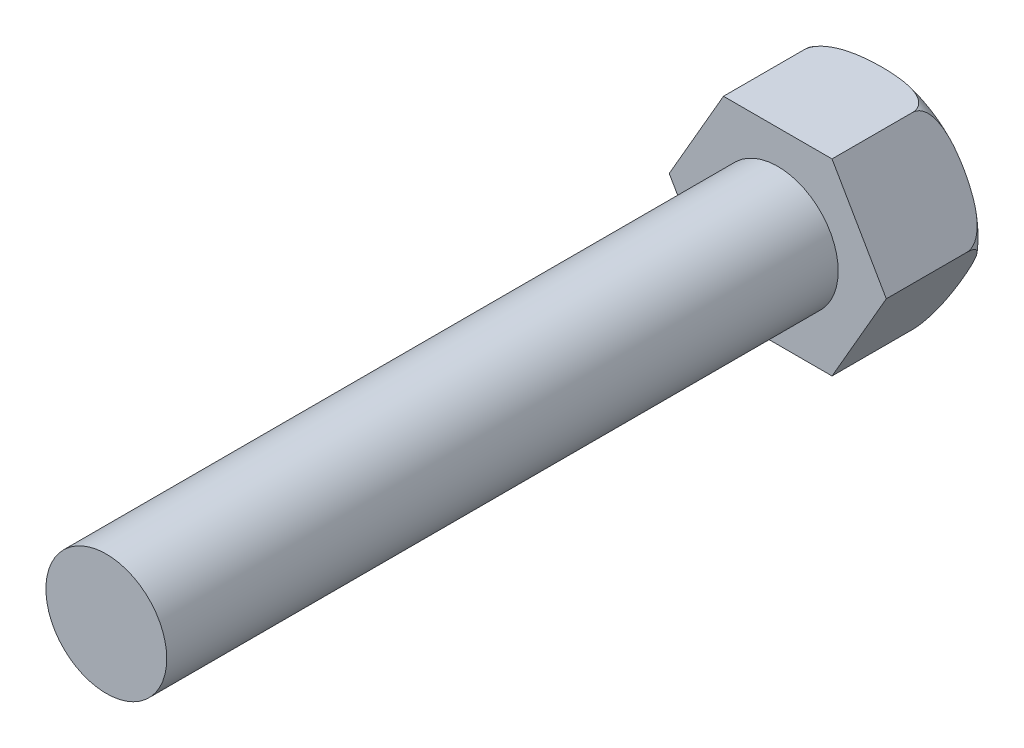
ISO-10303-21;
HEADER;
FILE_DESCRIPTION(('STEP AP214'),'2;1');
FILE_NAME('part.step','',(''),(''),'','','');
FILE_SCHEMA(('AUTOMOTIVE_DESIGN { 1 0 10303 214 1 1 1 1 }'));
ENDSEC;
DATA;
#1=APPLICATION_CONTEXT('core data for automotive mechanical design processes');
#2=APPLICATION_PROTOCOL_DEFINITION('international standard','automotive_design',2000,#1);
#3=PRODUCT_CONTEXT('',#1,'mechanical');
#4=PRODUCT('Part','Part','',(#3));
#5=PRODUCT_RELATED_PRODUCT_CATEGORY('part','',(#4));
#6=PRODUCT_DEFINITION_FORMATION('','',#4);
#7=PRODUCT_DEFINITION_CONTEXT('part definition',#1,'design');
#8=PRODUCT_DEFINITION('design','',#6,#7);
#9=PRODUCT_DEFINITION_SHAPE('','',#8);
#10=(LENGTH_UNIT() NAMED_UNIT(*) SI_UNIT(.MILLI.,.METRE.));
#11=(NAMED_UNIT(*) PLANE_ANGLE_UNIT() SI_UNIT($,.RADIAN.));
#12=(NAMED_UNIT(*) SI_UNIT($,.STERADIAN.) SOLID_ANGLE_UNIT());
#13=UNCERTAINTY_MEASURE_WITH_UNIT(LENGTH_MEASURE(1.E-05),#10,'distance_accuracy_value','');
#14=(GEOMETRIC_REPRESENTATION_CONTEXT(3) GLOBAL_UNCERTAINTY_ASSIGNED_CONTEXT((#13)) GLOBAL_UNIT_ASSIGNED_CONTEXT((#10,
#11,#12)) REPRESENTATION_CONTEXT('',''));
#15=CARTESIAN_POINT('',(0.,0.,0.));
#16=DIRECTION('',(0.,0.,1.));
#17=DIRECTION('',(1.,0.,0.));
#18=AXIS2_PLACEMENT_3D('',#15,#16,#17);
#19=CARTESIAN_POINT('',(-2.02072594216374,3.49999999999999,4.));
#20=DIRECTION('',(0.866025403784441,-0.499999999999995,0.));
#21=DIRECTION('',(0.499999999999995,0.866025403784442,0.));
#22=AXIS2_PLACEMENT_3D('',#19,#20,#21);
#23=PLANE('',#22);
#24=DIRECTION('',(0.,0.,-1.));
#25=VECTOR('',#24,1.);
#26=CARTESIAN_POINT('',(-2.02072594216374,3.49999999999999,4.));
#27=LINE('',#26,#25);
#28=CARTESIAN_POINT('',(-2.02072594216374,3.49999999999999,4.));
#29=VERTEX_POINT('',#28);
#30=CARTESIAN_POINT('',(-2.02072594216374,3.49999999999999,1.));
#31=VERTEX_POINT('',#30);
#32=EDGE_CURVE('E123',#29,#31,#27,.T.);
#33=ORIENTED_EDGE('',*,*,#32,.T.);
#34=CARTESIAN_POINT('',(-2.02072596216374,3.49999996535897,1.0002));
#35=CARTESIAN_POINT('',(-2.02068817582572,3.50006541321624,0.970539952036359));
#36=CARTESIAN_POINT('',(-2.02203159037863,3.49773855095497,0.940943419479964));
#37=CARTESIAN_POINT('',(-2.02720767097232,3.48877331638264,0.882862626746315));
#38=CARTESIAN_POINT('',(-2.03102080305429,3.48216877788069,0.854371482157116));
#39=CARTESIAN_POINT('',(-2.04085887550783,3.46512873654261,0.799065520064267));
#40=CARTESIAN_POINT('',(-2.04687853402016,3.45470238215505,0.772246876943075));
#41=CARTESIAN_POINT('',(-2.06077100069921,3.43063992402447,0.720567976584995));
#42=CARTESIAN_POINT('',(-2.06864757781623,3.41699729226807,0.695711841418098));
#43=CARTESIAN_POINT('',(-2.09083279125199,3.37857137542057,0.634565255758074));
#44=CARTESIAN_POINT('',(-2.10624257543249,3.35188084628626,0.599872836801562));
#45=CARTESIAN_POINT('',(-2.13958634984201,3.29412773489287,0.535760566404515));
#46=CARTESIAN_POINT('',(-2.15752643069669,3.26305460336067,0.50635383836868));
#47=CARTESIAN_POINT('',(-2.20723104407242,3.17696368762334,0.434803812299114));
#48=CARTESIAN_POINT('',(-2.24043900247738,3.1194458164503,0.396705903350538));
#49=CARTESIAN_POINT('',(-2.30920949875717,3.00033182283197,0.33056291363866));
#50=CARTESIAN_POINT('',(-2.34477664737359,2.93872771434799,0.302538249046195));
#51=CARTESIAN_POINT('',(-2.4286652674482,2.79342836220192,0.246483331230397));
#52=CARTESIAN_POINT('',(-2.47744873333339,2.70893292071946,0.221280185573147));
#53=CARTESIAN_POINT('',(-2.57602370961184,2.5381960534503,0.180228139089704));
#54=CARTESIAN_POINT('',(-2.62581718114355,2.45195123087214,0.164399696051231));
#55=CARTESIAN_POINT('',(-2.7262053613218,2.27807380232402,0.139439112674214));
#56=CARTESIAN_POINT('',(-2.77680329261369,2.19043561456859,0.130361127291426));
#57=CARTESIAN_POINT('',(-2.87810459018527,2.01497662030195,0.117476902530046));
#58=CARTESIAN_POINT('',(-2.92880780365479,1.92715607846573,0.113665482739167));
#59=CARTESIAN_POINT('',(-3.03451189205584,1.74407122678737,0.110435783190192));
#60=CARTESIAN_POINT('',(-3.08951570713436,1.64880182446124,0.111413779910928));
#61=CARTESIAN_POINT('',(-3.19949245222168,1.45831651431894,0.118901664446554));
#62=CARTESIAN_POINT('',(-3.25446529696283,1.36310075419069,0.125417058749453));
#63=CARTESIAN_POINT('',(-3.36360866202675,1.17405890059092,0.145334278662587));
#64=CARTESIAN_POINT('',(-3.41778193640118,1.08022803696206,0.158673083388078));
#65=CARTESIAN_POINT('',(-3.52529689545557,0.894006665306156,0.194857670852586));
#66=CARTESIAN_POINT('',(-3.57864007342531,0.801613570825379,0.217683653561177));
#67=CARTESIAN_POINT('',(-3.65856514529891,0.663179285541694,0.263060973879485));
#68=CARTESIAN_POINT('',(-3.68584926302553,0.615921807399501,0.28061611324548));
#69=CARTESIAN_POINT('',(-3.73960488591475,0.522814337362859,0.320479546916686));
#70=CARTESIAN_POINT('',(-3.76607506609612,0.476966640403228,0.342795165816101));
#71=CARTESIAN_POINT('',(-3.81783708230964,0.387312198419198,0.39340133475258));
#72=CARTESIAN_POINT('',(-3.84311779853436,0.343524713466266,0.421738252401259));
#73=CARTESIAN_POINT('',(-3.89135451285731,0.259976273468717,0.485506076596322));
#74=CARTESIAN_POINT('',(-3.91431545999465,0.220206746436947,0.520921379349165));
#75=CARTESIAN_POINT('',(-3.94867956472225,0.160686371092126,0.585394456329523));
#76=CARTESIAN_POINT('',(-3.96122763121273,0.138952482393863,0.611999800677176));
#77=CARTESIAN_POINT('',(-3.98425308097252,0.0990712335427797,0.668614145139174));
#78=CARTESIAN_POINT('',(-3.99473238349627,0.0809205491437591,0.698619949468692));
#79=CARTESIAN_POINT('',(-4.01162741083323,0.0516575034008868,0.757213477459444));
#80=CARTESIAN_POINT('',(-4.01841258951132,0.0399052291919867,0.785371920675711));
#81=CARTESIAN_POINT('',(-4.02953619723163,0.0206385754569454,0.843544462757356));
#82=CARTESIAN_POINT('',(-4.03387985084702,0.0131151467046103,0.873554445540551));
#83=CARTESIAN_POINT('',(-4.03836362228016,0.00534902677289837,0.919901391483951));
#84=CARTESIAN_POINT('',(-4.03952070098148,0.00334490767385609,0.935863716925656));
#85=CARTESIAN_POINT('',(-4.041067656788,0.000665501619884298,0.967947332354781));
#86=CARTESIAN_POINT('',(-4.04145699118339,-8.84533406489121E-06,0.984068726701695));
#87=CARTESIAN_POINT('',(-4.04145186432739,3.46410156722759E-08,1.0002));
#88=B_SPLINE_CURVE_WITH_KNOTS('',3,(#34,#35,#36,#37,#38,#39,#40,#41,#42,#43,#44,#45,#46,#47,#48,
#49,#50,#51,#52,#53,#54,#55,#56,#57,#58,#59,#60,#61,#62,#63,#64,#65,#66,#67,#68,#69,#70,#71,#72,
#73,#74,#75,#76,#77,#78,#79,#80,#81,#82,#83,#84,#85,#86,#87),.UNSPECIFIED.,.F.,.F.,(4,2,2,2,2,2,
2,2,2,2,2,2,2,2,2,2,2,2,2,2,2,2,2,2,2,2,4),(0.,0.0887549682168752,0.176816372559745,
0.264668342544665,0.352700182823118,0.491116926586738,0.629872724562834,0.858271992931106,
1.08713159852034,1.38870326235111,1.6909306239955,1.99555716759984,2.29988385408505,
2.62979570690824,2.9600360144027,3.28727986533296,3.61384415075228,3.78564861623522,
3.9577193559799,4.13116655021791,4.3042355279351,4.41365097803449,4.52296443811821,
4.61636709926976,4.70956912141676,4.75789060739828,4.80624623906771),.UNSPECIFIED.);
#89=CARTESIAN_POINT('',(-4.04145188432739,0.,1.));
#90=VERTEX_POINT('',#89);
#91=EDGE_CURVE('E58',#31,#90,#88,.T.);
#92=ORIENTED_EDGE('',*,*,#91,.T.);
#93=DIRECTION('',(0.,0.,-1.));
#94=VECTOR('',#93,1.);
#95=CARTESIAN_POINT('',(-4.04145188432739,0.,4.));
#96=LINE('',#95,#94);
#97=CARTESIAN_POINT('',(-4.04145188432739,0.,4.));
#98=VERTEX_POINT('',#97);
#99=EDGE_CURVE('E46',#98,#90,#96,.T.);
#100=ORIENTED_EDGE('',*,*,#99,.F.);
#101=DIRECTION('',(-0.499999999999995,-0.866025403784441,0.));
#102=VECTOR('',#101,1.);
#103=CARTESIAN_POINT('',(-2.02072594216374,3.49999999999999,4.));
#104=LINE('',#103,#102);
#105=EDGE_CURVE('E140',#29,#98,#104,.T.);
#106=ORIENTED_EDGE('',*,*,#105,.F.);
#107=EDGE_LOOP('',(#33,#92,#100,#106));
#108=FACE_BOUND('',#107,.T.);
#109=ADVANCED_FACE('F42',(#108),#23,.F.);
#110=CARTESIAN_POINT('',(-4.04145188432739,0.,4.));
#111=DIRECTION('',(0.866025403784438,0.500000000000001,0.));
#112=DIRECTION('',(-0.500000000000001,0.866025403784438,0.));
#113=AXIS2_PLACEMENT_3D('',#110,#111,#112);
#114=PLANE('',#113);
#115=ORIENTED_EDGE('',*,*,#99,.T.);
#116=CARTESIAN_POINT('',(-4.04145186432739,-3.46410165452075E-08,1.0002));
#117=CARTESIAN_POINT('',(-4.0414896506654,6.54132162492107E-05,0.970539952036359));
#118=CARTESIAN_POINT('',(-4.04014623611249,-0.00226144904501481,0.940943419479964));
#119=CARTESIAN_POINT('',(-4.03497015551881,-0.0112266836173497,0.882862626746314));
#120=CARTESIAN_POINT('',(-4.03115702343684,-0.0178312221192933,0.854371482157114));
#121=CARTESIAN_POINT('',(-4.02131895098329,-0.034871263457372,0.799065520064265));
#122=CARTESIAN_POINT('',(-4.01529929247097,-0.0452976178449371,0.772246876943073));
#123=CARTESIAN_POINT('',(-4.00140682579191,-0.0693600759755188,0.720567976584993));
#124=CARTESIAN_POINT('',(-3.9935302486749,-0.083002707731921,0.695711841418096));
#125=CARTESIAN_POINT('',(-3.97134503523914,-0.12142862457942,0.634565255758071));
#126=CARTESIAN_POINT('',(-3.95593525105863,-0.148119153713723,0.599872836801559));
#127=CARTESIAN_POINT('',(-3.92259147664912,-0.205872265107118,0.53576056640451));
#128=CARTESIAN_POINT('',(-3.90465139579444,-0.236945396639321,0.506353838368675));
#129=CARTESIAN_POINT('',(-3.85494678241871,-0.32303631237665,0.434803812299108));
#130=CARTESIAN_POINT('',(-3.82173882401374,-0.38055418354969,0.396705903350533));
#131=CARTESIAN_POINT('',(-3.75296832773395,-0.499668177168017,0.330562913638654));
#132=CARTESIAN_POINT('',(-3.71740117911753,-0.561272285651995,0.302538249046189));
#133=CARTESIAN_POINT('',(-3.63351255904292,-0.706571637798075,0.246483331230391));
#134=CARTESIAN_POINT('',(-3.58472909315772,-0.79106707928053,0.22128018557314));
#135=CARTESIAN_POINT('',(-3.48615411687928,-0.961803946549694,0.180228139089697));
#136=CARTESIAN_POINT('',(-3.43636064534757,-1.04804876912785,0.164399696051224));
#137=CARTESIAN_POINT('',(-3.33597246516931,-1.22192619767598,0.139439112674207));
#138=CARTESIAN_POINT('',(-3.28537453387742,-1.30956438543141,0.130361127291418));
#139=CARTESIAN_POINT('',(-3.18407323630583,-1.48502337969805,0.117476902530039));
#140=CARTESIAN_POINT('',(-3.13337002283631,-1.57284392153427,0.11366548273916));
#141=CARTESIAN_POINT('',(-3.02766593443527,-1.75592877321263,0.110435783190185));
#142=CARTESIAN_POINT('',(-2.97266211935674,-1.85119817553877,0.111413779910921));
#143=CARTESIAN_POINT('',(-2.86268537426941,-2.04168348568106,0.118901664446546));
#144=CARTESIAN_POINT('',(-2.80771252952827,-2.13689924580932,0.125417058749446));
#145=CARTESIAN_POINT('',(-2.69856916446434,-2.32594109940908,0.14533427866258));
#146=CARTESIAN_POINT('',(-2.64439589008992,-2.41977196303795,0.158673083388071));
#147=CARTESIAN_POINT('',(-2.53688093103552,-2.60599333469385,0.194857670852579));
#148=CARTESIAN_POINT('',(-2.48353775306578,-2.69838642917463,0.21768365356117));
#149=CARTESIAN_POINT('',(-2.40361268119217,-2.83682071445832,0.263060973879479));
#150=CARTESIAN_POINT('',(-2.37632856346555,-2.88407819260051,0.280616113245473));
#151=CARTESIAN_POINT('',(-2.32257294057633,-2.97718566263715,0.320479546916679));
#152=CARTESIAN_POINT('',(-2.29610276039496,-3.02303335959678,0.342795165816095));
#153=CARTESIAN_POINT('',(-2.24434074418144,-3.11268780158081,0.393401334752574));
#154=CARTESIAN_POINT('',(-2.21906002795673,-3.15647528653375,0.421738252401254));
#155=CARTESIAN_POINT('',(-2.17082331363377,-3.2400237265313,0.485506076596317));
#156=CARTESIAN_POINT('',(-2.14786236649643,-3.27979325356307,0.52092137934916));
#157=CARTESIAN_POINT('',(-2.11349826176883,-3.33931362890789,0.585394456329519));
#158=CARTESIAN_POINT('',(-2.10095019527835,-3.36104751760615,0.611999800677172));
#159=CARTESIAN_POINT('',(-2.07792474551856,-3.40092876645723,0.668614145139171));
#160=CARTESIAN_POINT('',(-2.06744544299481,-3.41907945085625,0.69861994946869));
#161=CARTESIAN_POINT('',(-2.05055041565785,-3.44834249659913,0.757213477459442));
#162=CARTESIAN_POINT('',(-2.04376523697975,-3.46009477080803,0.785371920675708));
#163=CARTESIAN_POINT('',(-2.03264162925945,-3.47936142454307,0.843544462757354));
#164=CARTESIAN_POINT('',(-2.02829797564406,-3.4868848532954,0.87355444554055));
#165=CARTESIAN_POINT('',(-2.02381420421092,-3.49465097322712,0.919901391483951));
#166=CARTESIAN_POINT('',(-2.0226571255096,-3.49665509232616,0.935863716925655));
#167=CARTESIAN_POINT('',(-2.02111016970307,-3.49933449838013,0.96794733235478));
#168=CARTESIAN_POINT('',(-2.02072083530768,-3.50000884533408,0.984068726701695));
#169=CARTESIAN_POINT('',(-2.02072596216369,-3.499999965359,1.0002));
#170=B_SPLINE_CURVE_WITH_KNOTS('',3,(#116,#117,#118,#119,#120,#121,#122,#123,#124,#125,#126,
#127,#128,#129,#130,#131,#132,#133,#134,#135,#136,#137,#138,#139,#140,#141,#142,#143,#144,#145,
#146,#147,#148,#149,#150,#151,#152,#153,#154,#155,#156,#157,#158,#159,#160,#161,#162,#163,#164,
#165,#166,#167,#168,#169),.UNSPECIFIED.,.F.,.F.,(4,2,2,2,2,2,2,2,2,2,2,2,2,2,2,2,2,2,2,2,2,2,2,
2,2,2,4),(0.,0.088754968216876,0.176816372559746,0.264668342544667,0.352700182823122,
0.491116926586743,0.629872724562839,0.858271992931113,1.08713159852035,1.38870326235112,
1.69093062399551,1.99555716759986,2.29988385408507,2.62979570690827,2.96003601440273,
3.287279865333,3.61384415075233,3.78564861623527,3.95771935597994,4.13116655021796,
4.30423552793515,4.41365097803454,4.52296443811827,4.61636709926981,4.70956912141682,
4.75789060739834,4.80624623906777),.UNSPECIFIED.);
#171=CARTESIAN_POINT('',(-2.02072594216369,-3.50000000000001,1.));
#172=VERTEX_POINT('',#171);
#173=EDGE_CURVE('E135',#90,#172,#170,.T.);
#174=ORIENTED_EDGE('',*,*,#173,.T.);
#175=DIRECTION('',(0.,0.,-1.));
#176=VECTOR('',#175,1.);
#177=CARTESIAN_POINT('',(-2.02072594216369,-3.50000000000001,4.));
#178=LINE('',#177,#176);
#179=CARTESIAN_POINT('',(-2.02072594216369,-3.50000000000001,4.));
#180=VERTEX_POINT('',#179);
#181=EDGE_CURVE('E121',#180,#172,#178,.T.);
#182=ORIENTED_EDGE('',*,*,#181,.F.);
#183=DIRECTION('',(0.500000000000001,-0.866025403784438,0.));
#184=VECTOR('',#183,1.);
#185=CARTESIAN_POINT('',(-4.04145188432739,0.,4.));
#186=LINE('',#185,#184);
#187=EDGE_CURVE('E136',#98,#180,#186,.T.);
#188=ORIENTED_EDGE('',*,*,#187,.F.);
#189=EDGE_LOOP('',(#115,#174,#182,#188));
#190=FACE_BOUND('',#189,.T.);
#191=ADVANCED_FACE('F134',(#190),#114,.F.);
#192=CARTESIAN_POINT('',(-2.02072594216369,-3.50000000000001,4.));
#193=DIRECTION('',(0.,1.,0.));
#194=DIRECTION('',(-1.,0.,0.));
#195=AXIS2_PLACEMENT_3D('',#192,#193,#194);
#196=PLANE('',#195);
#197=ORIENTED_EDGE('',*,*,#181,.T.);
#198=CARTESIAN_POINT('',(0.,-3.50000000007456,0.111330418156541));
#199=CARTESIAN_POINT('',(0.0863268373511369,-3.50000000006624,0.111335246329109));
#200=CARTESIAN_POINT('',(0.172651630221231,-3.50000000001775,0.112960961587366));
#201=CARTESIAN_POINT('',(0.345200003870178,-3.49999999998225,0.119701341393557));
#202=CARTESIAN_POINT('',(0.43142354409981,-3.49999999999526,0.124817107081153));
#203=CARTESIAN_POINT('',(0.6033544744787,-3.50000000000475,0.139204495296834));
#204=CARTESIAN_POINT('',(0.689062566839368,-3.50000000000127,0.14846740730199));
#205=CARTESIAN_POINT('',(0.859711107049833,-3.49999999999874,0.172316148942656));
#206=CARTESIAN_POINT('',(0.944652059020943,-3.49999999999969,0.186898175634881));
#207=CARTESIAN_POINT('',(1.10047939406719,-3.50000000000027,0.220434724398314));
#208=CARTESIAN_POINT('',(1.17157101595006,-3.50000000000007,0.23841159854073));
#209=CARTESIAN_POINT('',(1.31198004970415,-3.49999999999993,0.281043848336298));
#210=CARTESIAN_POINT('',(1.3812929135405,-3.49999999999998,0.305714775512425));
#211=CARTESIAN_POINT('',(1.51730819471408,-3.50000000000002,0.364074852443847));
#212=CARTESIAN_POINT('',(1.58395793938909,-3.50000000000001,0.397890024858378));
#213=CARTESIAN_POINT('',(1.71012924795543,-3.5,0.476882282848067));
#214=CARTESIAN_POINT('',(1.7696901952163,-3.5,0.521991809858896));
#215=CARTESIAN_POINT('',(1.84774561871332,-3.5,0.598547741916628));
#216=CARTESIAN_POINT('',(1.87138500673582,-3.5,0.624736328072921));
#217=CARTESIAN_POINT('',(1.91465839783832,-3.5,0.680291306059996));
#218=CARTESIAN_POINT('',(1.9342927531843,-3.5,0.709657418060819));
#219=CARTESIAN_POINT('',(1.96851600968599,-3.5,0.771683779711007));
#220=CARTESIAN_POINT('',(1.98304564053898,-3.5,0.804377383263174));
#221=CARTESIAN_POINT('',(2.00542501635481,-3.5,0.87197929531124));
#222=CARTESIAN_POINT('',(2.01328508766553,-3.5,0.906884089873654));
#223=CARTESIAN_POINT('',(2.02095945080334,-3.5,0.97306670821964));
#224=CARTESIAN_POINT('',(2.02166949229543,-3.5,1.00424156174998));
#225=CARTESIAN_POINT('',(2.01730141618943,-3.5,1.06618058392373));
#226=CARTESIAN_POINT('',(2.01222343066468,-3.5,1.09694476192188));
#227=CARTESIAN_POINT('',(1.99739983496589,-3.5,1.15449803171169));
#228=CARTESIAN_POINT('',(1.98808984961504,-3.5,1.18140223354418));
#229=CARTESIAN_POINT('',(1.96561338738324,-3.5,1.23352794190807));
#230=CARTESIAN_POINT('',(1.95244609403789,-3.5,1.25874909080379));
#231=CARTESIAN_POINT('',(1.9158596365539,-3.5,1.31880585049003));
#232=CARTESIAN_POINT('',(1.89054654515402,-3.5,1.35248730372608));
#233=CARTESIAN_POINT('',(1.83488053814157,-3.5,1.41540243919151));
#234=CARTESIAN_POINT('',(1.80451416228507,-3.5,1.44462383172482));
#235=CARTESIAN_POINT('',(1.72189631665257,-3.5,1.51439273265289));
#236=CARTESIAN_POINT('',(1.66706197332647,-3.5,1.55185799372111));
#237=CARTESIAN_POINT('',(1.55256598485758,-3.5,1.61819274394806));
#238=CARTESIAN_POINT('',(1.49289865512113,-3.5,1.64705191824977));
#239=CARTESIAN_POINT('',(1.37212120964049,-3.5,1.69737442592764));
#240=CARTESIAN_POINT('',(1.31107157578327,-3.5,1.71898629142694));
#241=CARTESIAN_POINT('',(1.18734677598379,-3.5,1.75701611762148));
#242=CARTESIAN_POINT('',(1.12466994405605,-3.5,1.77342850814584));
#243=CARTESIAN_POINT('',(0.99795943911839,-3.5,1.80218468596574));
#244=CARTESIAN_POINT('',(0.933919410905593,-3.5,1.81449981774043));
#245=CARTESIAN_POINT('',(0.805330667378366,-3.5,1.83572898154437));
#246=CARTESIAN_POINT('',(0.740782269512708,-3.5,1.84464498710576));
#247=CARTESIAN_POINT('',(0.598058687169465,-3.5,1.86126732044955));
#248=CARTESIAN_POINT('',(0.519811880464048,-3.50000000000001,1.86834748202612));
#249=CARTESIAN_POINT('',(0.363081327244781,-3.50000000000001,1.87926131335637));
#250=CARTESIAN_POINT('',(0.28459752230512,-3.50000000000001,1.88309410343157));
#251=CARTESIAN_POINT('',(0.127339560518607,-3.50000000000001,1.88794374366901));
#252=CARTESIAN_POINT('',(0.0485651820359701,-3.50000000000001,1.88895318175163));
#253=CARTESIAN_POINT('',(-0.108959437840749,-3.50000000000001,1.88825152685298));
#254=CARTESIAN_POINT('',(-0.187709681082006,-3.50000000000001,1.88654086355345));
#255=CARTESIAN_POINT('',(-0.344482466810143,-3.50000000000001,1.88022824930812));
#256=CARTESIAN_POINT('',(-0.422505891913692,-3.50000000000001,1.87564896778357));
#257=CARTESIAN_POINT('',(-0.578320125862924,-3.50000000000001,1.86311520553163));
#258=CARTESIAN_POINT('',(-0.656110842414092,-3.50000000000001,1.85515952855743));
#259=CARTESIAN_POINT('',(-0.810862616601849,-3.50000000000001,1.83507644898779));
#260=CARTESIAN_POINT('',(-0.887825711400737,-3.50000000000001,1.82296515299722));
#261=CARTESIAN_POINT('',(-1.0406918182419,-3.50000000000001,1.79337838428053));
#262=CARTESIAN_POINT('',(-1.1165957697496,-3.50000000000001,1.77590802933686));
#263=CARTESIAN_POINT('',(-1.22622138878738,-3.50000000000001,1.74521247574362));
#264=CARTESIAN_POINT('',(-1.26071408734604,-3.50000000000001,1.73474277194583));
#265=CARTESIAN_POINT('',(-1.32913620453997,-3.50000000000001,1.71208410200551));
#266=CARTESIAN_POINT('',(-1.36306544190612,-3.50000000000001,1.69989459412396));
#267=CARTESIAN_POINT('',(-1.46365216182296,-3.50000000000001,1.66044083243199));
#268=CARTESIAN_POINT('',(-1.52924178274829,-3.50000000000001,1.63025612718197));
#269=CARTESIAN_POINT('',(-1.63826125151039,-3.50000000000001,1.56929419229611));
#270=CARTESIAN_POINT('',(-1.68295511828951,-3.50000000000001,1.54079671502105));
#271=CARTESIAN_POINT('',(-1.76768051340473,-3.50000000000001,1.47745759388056));
#272=CARTESIAN_POINT('',(-1.80771883048811,-3.50000000000001,1.44262538248086));
#273=CARTESIAN_POINT('',(-1.86880478077615,-3.50000000000001,1.37820337847556));
#274=CARTESIAN_POINT('',(-1.89183062207856,-3.50000000000001,1.35049996795742));
#275=CARTESIAN_POINT('',(-1.93330435972622,-3.50000000000001,1.29184447154719));
#276=CARTESIAN_POINT('',(-1.95175915438752,-3.50000000000001,1.26089738250093));
#277=CARTESIAN_POINT('',(-1.98020381119012,-3.50000000000001,1.20152416571651));
#278=CARTESIAN_POINT('',(-1.99108975304045,-3.50000000000001,1.17353048855178));
#279=CARTESIAN_POINT('',(-2.00802811826672,-3.50000000000001,1.11610730771977));
#280=CARTESIAN_POINT('',(-2.01408338566606,-3.50000000000001,1.08667865972719));
#281=CARTESIAN_POINT('',(-2.02088735244227,-3.50000000000001,1.02709310303668));
#282=CARTESIAN_POINT('',(-2.02161631040514,-3.50000000000001,0.996933900342925));
#283=CARTESIAN_POINT('',(-2.01765062564484,-3.50000000000001,0.936976577192134));
#284=CARTESIAN_POINT('',(-2.01295539720496,-3.50000000000001,0.907178496081002));
#285=CARTESIAN_POINT('',(-1.99894363427692,-3.50000000000001,0.850481346106491));
#286=CARTESIAN_POINT('',(-1.98990016482534,-3.50000000000001,0.823513341042048));
#287=CARTESIAN_POINT('',(-1.96792176263356,-3.50000000000001,0.771228777144889));
#288=CARTESIAN_POINT('',(-1.95498534460753,-3.50000000000001,0.745912853128543));
#289=CARTESIAN_POINT('',(-1.91910314931317,-3.50000000000001,0.685899777957165));
#290=CARTESIAN_POINT('',(-1.89430007452803,-3.50000000000001,0.652313433687575));
#291=CARTESIAN_POINT('',(-1.83966536048486,-3.50000000000001,0.58952468552393));
#292=CARTESIAN_POINT('',(-1.80982214788902,-3.50000000000001,0.560332670633406));
#293=CARTESIAN_POINT('',(-1.72878496826608,-3.50000000000001,0.490784110163384));
#294=CARTESIAN_POINT('',(-1.67504338750706,-3.50000000000001,0.453418762620322));
#295=CARTESIAN_POINT('',(-1.56265233254226,-3.50000000000002,0.387093208221533));
#296=CARTESIAN_POINT('',(-1.50399107201063,-3.50000000000002,0.358153974670652));
#297=CARTESIAN_POINT('',(-1.38547326892355,-3.5,0.307726313670706));
#298=CARTESIAN_POINT('',(-1.3256914227691,-3.49999999999997,0.286058271033035));
#299=CARTESIAN_POINT('',(-1.20448970992339,-3.50000000000006,0.247829085707374));
#300=CARTESIAN_POINT('',(-1.14306820600186,-3.50000000000018,0.231273272012171));
#301=CARTESIAN_POINT('',(-1.01920506336019,-3.49999999999984,0.202253669153354));
#302=CARTESIAN_POINT('',(-0.956762233281853,-3.49999999999938,0.189795078954428));
#303=CARTESIAN_POINT('',(-0.831296237180196,-3.50000000000064,0.16820462466897));
#304=CARTESIAN_POINT('',(-0.768272874657506,-3.50000000000235,0.159073932872721));
#305=CARTESIAN_POINT('',(-0.588181080239143,-3.49999999999567,0.136896020884186));
#306=CARTESIAN_POINT('',(-0.470713518093531,-3.49999999997744,0.127117725389755));
#307=CARTESIAN_POINT('',(-0.235495968123293,-3.50000000002257,0.114332710520504));
#308=CARTESIAN_POINT('',(-0.117746082307542,-3.50000000008592,0.111323832737428));
#309=CARTESIAN_POINT('',(0.,-3.50000000007456,0.111330418156541));
#310=B_SPLINE_CURVE_WITH_KNOTS('',3,(#198,#199,#200,#201,#202,#203,#204,#205,#206,#207,#208,
#209,#210,#211,#212,#213,#214,#215,#216,#217,#218,#219,#220,#221,#222,#223,#224,#225,#226,#227,
#228,#229,#230,#231,#232,#233,#234,#235,#236,#237,#238,#239,#240,#241,#242,#243,#244,#245,#246,
#247,#248,#249,#250,#251,#252,#253,#254,#255,#256,#257,#258,#259,#260,#261,#262,#263,#264,#265,
#266,#267,#268,#269,#270,#271,#272,#273,#274,#275,#276,#277,#278,#279,#280,#281,#282,#283,#284,
#285,#286,#287,#288,#289,#290,#291,#292,#293,#294,#295,#296,#297,#298,#299,#300,#301,#302,#303,
#304,#305,#306,#307,#308,#309),.UNSPECIFIED.,.T.,.F.,(4,2,2,2,2,2,2,2,2,2,2,2,2,2,2,2,2,2,2,2,2,
2,2,2,2,2,2,2,2,2,2,2,2,2,2,2,2,2,2,2,2,2,2,2,2,2,2,2,2,2,2,2,2,2,2,4),(0.,0.258960481092414,
0.518002704159163,0.776503377919463,1.03481959565785,1.25457530455913,1.4748459837553,
1.69832240855697,1.92049274823905,2.02603918876457,2.13157634185812,2.2383012489373,
2.34486061285935,2.4378744155339,2.53088609582786,2.61595499676754,2.7010419170033,
2.82672538584922,2.95274915496421,3.1508585970115,3.34920453824616,3.54319361959882,
3.73738982315099,3.93291697078464,4.12833042186907,4.36394350818741,4.59962039920137,
4.83591542907704,5.0721731362354,5.30658695635894,5.54108389802157,5.77468204079338,
6.00805779337768,6.11615522421534,6.22428678213051,6.44013860851269,6.5987505196739,
6.75712816194006,6.86485155586152,6.97241137657421,7.06214192551981,7.15181960720954,
7.24182950212322,7.33184911743049,7.41683554592712,7.50185444069459,7.62640196934792,
7.75123947664184,7.9464975550249,8.14223757181762,8.33270789009532,8.5233760897548,
8.71428530299064,8.90526170133228,9.25858529901851,9.61179622457449),.UNSPECIFIED.);
#311=CARTESIAN_POINT('',(2.02072594216371,-3.5,1.));
#312=VERTEX_POINT('',#311);
#313=EDGE_CURVE('E115',#172,#312,#310,.T.);
#314=ORIENTED_EDGE('',*,*,#313,.T.);
#315=DIRECTION('',(0.,0.,-1.));
#316=VECTOR('',#315,1.);
#317=CARTESIAN_POINT('',(2.02072594216371,-3.5,4.));
#318=LINE('',#317,#316);
#319=CARTESIAN_POINT('',(2.02072594216371,-3.5,4.));
#320=VERTEX_POINT('',#319);
#321=EDGE_CURVE('E114',#320,#312,#318,.T.);
#322=ORIENTED_EDGE('',*,*,#321,.F.);
#323=DIRECTION('',(1.,0.,0.));
#324=VECTOR('',#323,1.);
#325=CARTESIAN_POINT('',(-2.02072594216369,-3.50000000000001,4.));
#326=LINE('',#325,#324);
#327=EDGE_CURVE('E282',#180,#320,#326,.T.);
#328=ORIENTED_EDGE('',*,*,#327,.F.);
#329=EDGE_LOOP('',(#197,#314,#322,#328));
#330=FACE_BOUND('',#329,.T.);
#331=ADVANCED_FACE('F188',(#330),#196,.F.);
#332=CARTESIAN_POINT('',(2.02072594216371,-3.5,4.));
#333=DIRECTION('',(-0.866025403784441,0.499999999999995,0.));
#334=DIRECTION('',(-0.499999999999995,-0.866025403784442,0.));
#335=AXIS2_PLACEMENT_3D('',#332,#333,#334);
#336=PLANE('',#335);
#337=ORIENTED_EDGE('',*,*,#321,.T.);
#338=CARTESIAN_POINT('',(2.02072596216371,-3.49999996535898,1.0002));
#339=CARTESIAN_POINT('',(2.0206881758257,-3.50006541321625,0.970539952036359));
#340=CARTESIAN_POINT('',(2.02203159037861,-3.49773855095499,0.940943419479964));
#341=CARTESIAN_POINT('',(2.0272076709723,-3.48877331638265,0.882862626746313));
#342=CARTESIAN_POINT('',(2.03102080305427,-3.48216877788071,0.854371482157114));
#343=CARTESIAN_POINT('',(2.04085887550781,-3.46512873654263,0.799065520064264));
#344=CARTESIAN_POINT('',(2.04687853402013,-3.45470238215506,0.772246876943072));
#345=CARTESIAN_POINT('',(2.06077100069919,-3.43063992402448,0.720567976584992));
#346=CARTESIAN_POINT('',(2.0686475778162,-3.41699729226808,0.695711841418095));
#347=CARTESIAN_POINT('',(2.09083279125197,-3.37857137542058,0.634565255758071));
#348=CARTESIAN_POINT('',(2.10624257543247,-3.35188084628628,0.599872836801558));
#349=CARTESIAN_POINT('',(2.13958634984198,-3.29412773489288,0.53576056640451));
#350=CARTESIAN_POINT('',(2.15752643069666,-3.26305460336068,0.506353838368675));
#351=CARTESIAN_POINT('',(2.20723104407239,-3.17696368762335,0.434803812299108));
#352=CARTESIAN_POINT('',(2.24043900247736,-3.11944581645031,0.396705903350533));
#353=CARTESIAN_POINT('',(2.30920949875715,-3.00033182283198,0.330562913638653));
#354=CARTESIAN_POINT('',(2.34477664737356,-2.938727714348,0.302538249046189));
#355=CARTESIAN_POINT('',(2.42866526744818,-2.79342836220192,0.24648333123039));
#356=CARTESIAN_POINT('',(2.47744873333337,-2.70893292071947,0.22128018557314));
#357=CARTESIAN_POINT('',(2.57602370961182,-2.5381960534503,0.180228139089696));
#358=CARTESIAN_POINT('',(2.62581718114353,-2.45195123087214,0.164399696051223));
#359=CARTESIAN_POINT('',(2.72620536132179,-2.27807380232401,0.139439112674206));
#360=CARTESIAN_POINT('',(2.77680329261368,-2.19043561456859,0.130361127291418));
#361=CARTESIAN_POINT('',(2.87810459018526,-2.01497662030194,0.117476902530039));
#362=CARTESIAN_POINT('',(2.92880780365478,-1.92715607846573,0.11366548273916));
#363=CARTESIAN_POINT('',(3.03451189205583,-1.74407122678736,0.110435783190185));
#364=CARTESIAN_POINT('',(3.08951570713435,-1.64880182446122,0.111413779910921));
#365=CARTESIAN_POINT('',(3.19949245222168,-1.45831651431893,0.118901664446546));
#366=CARTESIAN_POINT('',(3.25446529696282,-1.36310075419067,0.125417058749446));
#367=CARTESIAN_POINT('',(3.36360866202675,-1.17405890059091,0.14533427866258));
#368=CARTESIAN_POINT('',(3.41778193640117,-1.08022803696204,0.158673083388072));
#369=CARTESIAN_POINT('',(3.52529689545557,-0.894006665306134,0.19485767085258));
#370=CARTESIAN_POINT('',(3.5786400734253,-0.801613570825355,0.217683653561171));
#371=CARTESIAN_POINT('',(3.65856514529891,-0.66317928554167,0.26306097387948));
#372=CARTESIAN_POINT('',(3.68584926302553,-0.615921807399475,0.280616113245474));
#373=CARTESIAN_POINT('',(3.73960488591475,-0.522814337362833,0.320479546916681));
#374=CARTESIAN_POINT('',(3.76607506609612,-0.476966640403202,0.342795165816097));
#375=CARTESIAN_POINT('',(3.81783708230964,-0.387312198419171,0.393401334752575));
#376=CARTESIAN_POINT('',(3.84311779853436,-0.343524713466239,0.421738252401254));
#377=CARTESIAN_POINT('',(3.89135451285731,-0.25997627346869,0.485506076596318));
#378=CARTESIAN_POINT('',(3.91431545999465,-0.220206746436921,0.520921379349162));
#379=CARTESIAN_POINT('',(3.94867956472225,-0.160686371092099,0.585394456329522));
#380=CARTESIAN_POINT('',(3.96122763121273,-0.138952482393836,0.611999800677174));
#381=CARTESIAN_POINT('',(3.98425308097252,-0.0990712335427519,0.668614145139173));
#382=CARTESIAN_POINT('',(3.99473238349627,-0.0809205491437316,0.698619949468692));
#383=CARTESIAN_POINT('',(4.01162741083323,-0.0516575034008583,0.757213477459444));
#384=CARTESIAN_POINT('',(4.01841258951132,-0.0399052291919573,0.785371920675711));
#385=CARTESIAN_POINT('',(4.02953619723163,-0.0206385754569161,0.843544462757356));
#386=CARTESIAN_POINT('',(4.03387985084702,-0.0131151467045819,0.873554445540552));
#387=CARTESIAN_POINT('',(4.03836362228016,-0.0053490267728706,0.919901391483953));
#388=CARTESIAN_POINT('',(4.03952070098148,-0.00334490767382841,0.935863716925656));
#389=CARTESIAN_POINT('',(4.041067656788,-0.000665501619856666,0.967947332354781));
#390=CARTESIAN_POINT('',(4.04145699118339,8.84533409251828E-06,0.984068726701695));
#391=CARTESIAN_POINT('',(4.04145186432739,-3.46409881977286E-08,1.0002));
#392=B_SPLINE_CURVE_WITH_KNOTS('',3,(#338,#339,#340,#341,#342,#343,#344,#345,#346,#347,#348,
#349,#350,#351,#352,#353,#354,#355,#356,#357,#358,#359,#360,#361,#362,#363,#364,#365,#366,#367,
#368,#369,#370,#371,#372,#373,#374,#375,#376,#377,#378,#379,#380,#381,#382,#383,#384,#385,#386,
#387,#388,#389,#390,#391),.UNSPECIFIED.,.F.,.F.,(4,2,2,2,2,2,2,2,2,2,2,2,2,2,2,2,2,2,2,2,2,2,2,
2,2,2,4),(0.,0.0887549682168763,0.176816372559747,0.264668342544668,0.352700182823123,
0.491116926586743,0.62987272456284,0.858271992931114,1.08713159852035,1.38870326235112,
1.69093062399551,1.99555716759986,2.29988385408508,2.62979570690828,2.96003601440274,
3.287279865333,3.61384415075233,3.78564861623527,3.95771935597995,4.13116655021796,
4.30423552793515,4.41365097803454,4.52296443811827,4.61636709926982,4.70956912141682,
4.75789060739834,4.80624623906777),.UNSPECIFIED.);
#393=CARTESIAN_POINT('',(4.04145188432739,0.,1.));
#394=VERTEX_POINT('',#393);
#395=EDGE_CURVE('E98',#312,#394,#392,.T.);
#396=ORIENTED_EDGE('',*,*,#395,.T.);
#397=DIRECTION('',(0.,0.,-1.));
#398=VECTOR('',#397,1.);
#399=CARTESIAN_POINT('',(4.04145188432739,0.,4.));
#400=LINE('',#399,#398);
#401=CARTESIAN_POINT('',(4.04145188432739,0.,4.));
#402=VERTEX_POINT('',#401);
#403=EDGE_CURVE('E111',#402,#394,#400,.T.);
#404=ORIENTED_EDGE('',*,*,#403,.F.);
#405=DIRECTION('',(0.499999999999995,0.866025403784442,0.));
#406=VECTOR('',#405,1.);
#407=CARTESIAN_POINT('',(2.02072594216371,-3.5,4.));
#408=LINE('',#407,#406);
#409=EDGE_CURVE('E278',#320,#402,#408,.T.);
#410=ORIENTED_EDGE('',*,*,#409,.F.);
#411=EDGE_LOOP('',(#337,#396,#404,#410));
#412=FACE_BOUND('',#411,.T.);
#413=ADVANCED_FACE('F109',(#412),#336,.F.);
#414=CARTESIAN_POINT('',(4.04145188432739,0.,4.));
#415=DIRECTION('',(-0.866025403784434,-0.500000000000007,0.));
#416=DIRECTION('',(0.500000000000007,-0.866025403784434,0.));
#417=AXIS2_PLACEMENT_3D('',#414,#415,#416);
#418=PLANE('',#417);
#419=ORIENTED_EDGE('',*,*,#403,.T.);
#420=CARTESIAN_POINT('',(4.04145186432739,3.46410447665146E-08,1.0002));
#421=CARTESIAN_POINT('',(4.0414896506654,-6.54132162221179E-05,0.970539952036359));
#422=CARTESIAN_POINT('',(4.04014623611249,0.00226144904504231,0.940943419479964));
#423=CARTESIAN_POINT('',(4.03497015551881,0.0112266836173785,0.882862626746314));
#424=CARTESIAN_POINT('',(4.03115702343684,0.0178312221193228,0.854371482157114));
#425=CARTESIAN_POINT('',(4.02131895098329,0.0348712634574012,0.799065520064264));
#426=CARTESIAN_POINT('',(4.01529929247097,0.045297617844965,0.772246876943072));
#427=CARTESIAN_POINT('',(4.00140682579191,0.0693600759755462,0.720567976584991));
#428=CARTESIAN_POINT('',(3.9935302486749,0.083002707731949,0.695711841418095));
#429=CARTESIAN_POINT('',(3.97134503523914,0.121428624579448,0.634565255758071));
#430=CARTESIAN_POINT('',(3.95593525105863,0.14811915371375,0.599872836801558));
#431=CARTESIAN_POINT('',(3.92259147664912,0.205872265107145,0.53576056640451));
#432=CARTESIAN_POINT('',(3.90465139579443,0.236945396639348,0.506353838368675));
#433=CARTESIAN_POINT('',(3.85494678241871,0.323036312376677,0.434803812299108));
#434=CARTESIAN_POINT('',(3.82173882401374,0.380554183549717,0.396705903350532));
#435=CARTESIAN_POINT('',(3.75296832773394,0.499668177168043,0.330562913638653));
#436=CARTESIAN_POINT('',(3.71740117911753,0.561272285652021,0.302538249046189));
#437=CARTESIAN_POINT('',(3.63351255904291,0.7065716377981,0.246483331230391));
#438=CARTESIAN_POINT('',(3.58472909315772,0.791067079280555,0.22128018557314));
#439=CARTESIAN_POINT('',(3.48615411687927,0.961803946549717,0.180228139089696));
#440=CARTESIAN_POINT('',(3.43636064534756,1.04804876912788,0.164399696051223));
#441=CARTESIAN_POINT('',(3.3359724651693,1.221926197676,0.139439112674207));
#442=CARTESIAN_POINT('',(3.28537453387741,1.30956438543143,0.130361127291418));
#443=CARTESIAN_POINT('',(3.18407323630582,1.48502337969807,0.117476902530039));
#444=CARTESIAN_POINT('',(3.1333700228363,1.57284392153429,0.11366548273916));
#445=CARTESIAN_POINT('',(3.02766593443525,1.75592877321265,0.110435783190185));
#446=CARTESIAN_POINT('',(2.97266211935673,1.85119817553878,0.111413779910921));
#447=CARTESIAN_POINT('',(2.8626853742694,2.04168348568108,0.118901664446546));
#448=CARTESIAN_POINT('',(2.80771252952826,2.13689924580933,0.125417058749446));
#449=CARTESIAN_POINT('',(2.69856916446433,2.3259410994091,0.145334278662579));
#450=CARTESIAN_POINT('',(2.6443958900899,2.41977196303796,0.15867308338807));
#451=CARTESIAN_POINT('',(2.5368809310355,2.60599333469387,0.194857670852577));
#452=CARTESIAN_POINT('',(2.48353775306576,2.69838642917464,0.217683653561168));
#453=CARTESIAN_POINT('',(2.40361268119215,2.83682071445833,0.263060973879477));
#454=CARTESIAN_POINT('',(2.37632856346553,2.88407819260052,0.280616113245471));
#455=CARTESIAN_POINT('',(2.32257294057631,2.97718566263717,0.320479546916677));
#456=CARTESIAN_POINT('',(2.29610276039494,3.0230333595968,0.342795165816093));
#457=CARTESIAN_POINT('',(2.24434074418142,3.11268780158083,0.393401334752572));
#458=CARTESIAN_POINT('',(2.21906002795671,3.15647528653376,0.421738252401251));
#459=CARTESIAN_POINT('',(2.17082331363375,3.24002372653131,0.485506076596315));
#460=CARTESIAN_POINT('',(2.14786236649641,3.27979325356308,0.520921379349159));
#461=CARTESIAN_POINT('',(2.11349826176881,3.3393136289079,0.585394456329519));
#462=CARTESIAN_POINT('',(2.10095019527833,3.36104751760616,0.611999800677171));
#463=CARTESIAN_POINT('',(2.07792474551854,3.40092876645725,0.66861414513917));
#464=CARTESIAN_POINT('',(2.06744544299479,3.41907945085627,0.698619949468688));
#465=CARTESIAN_POINT('',(2.05055041565783,3.44834249659914,0.75721347745944));
#466=CARTESIAN_POINT('',(2.04376523697973,3.46009477080804,0.785371920675707));
#467=CARTESIAN_POINT('',(2.03264162925942,3.47936142454308,0.843544462757353));
#468=CARTESIAN_POINT('',(2.02829797564403,3.48688485329542,0.873554445540549));
#469=CARTESIAN_POINT('',(2.0238142042109,3.49465097322713,0.91990139148395));
#470=CARTESIAN_POINT('',(2.02265712550958,3.49665509232617,0.935863716925654));
#471=CARTESIAN_POINT('',(2.02111016970305,3.49933449838014,0.96794733235478));
#472=CARTESIAN_POINT('',(2.02072083530766,3.50000884533409,0.984068726701695));
#473=CARTESIAN_POINT('',(2.02072596216366,3.49999996535901,1.0002));
#474=B_SPLINE_CURVE_WITH_KNOTS('',3,(#420,#421,#422,#423,#424,#425,#426,#427,#428,#429,#430,
#431,#432,#433,#434,#435,#436,#437,#438,#439,#440,#441,#442,#443,#444,#445,#446,#447,#448,#449,
#450,#451,#452,#453,#454,#455,#456,#457,#458,#459,#460,#461,#462,#463,#464,#465,#466,#467,#468,
#469,#470,#471,#472,#473),.UNSPECIFIED.,.F.,.F.,(4,2,2,2,2,2,2,2,2,2,2,2,2,2,2,2,2,2,2,2,2,2,2,
2,2,2,4),(0.,0.0887549682168764,0.176816372559747,0.264668342544668,0.352700182823123,
0.491116926586743,0.62987272456284,0.858271992931113,1.08713159852035,1.38870326235112,
1.69093062399551,1.99555716759986,2.29988385408507,2.62979570690827,2.96003601440273,
3.28727986533299,3.61384415075232,3.78564861623526,3.95771935597994,4.13116655021796,
4.30423552793514,4.41365097803454,4.52296443811827,4.61636709926982,4.70956912141682,
4.75789060739834,4.80624623906777),.UNSPECIFIED.);
#475=CARTESIAN_POINT('',(2.02072594216366,3.50000000000003,1.));
#476=VERTEX_POINT('',#475);
#477=EDGE_CURVE('E95',#394,#476,#474,.T.);
#478=ORIENTED_EDGE('',*,*,#477,.T.);
#479=DIRECTION('',(0.,0.,-1.));
#480=VECTOR('',#479,1.);
#481=CARTESIAN_POINT('',(2.02072594216366,3.50000000000003,4.));
#482=LINE('',#481,#480);
#483=CARTESIAN_POINT('',(2.02072594216366,3.50000000000003,4.));
#484=VERTEX_POINT('',#483);
#485=EDGE_CURVE('E119',#484,#476,#482,.T.);
#486=ORIENTED_EDGE('',*,*,#485,.F.);
#487=DIRECTION('',(-0.500000000000007,0.866025403784434,0.));
#488=VECTOR('',#487,1.);
#489=CARTESIAN_POINT('',(4.04145188432739,0.,4.));
#490=LINE('',#489,#488);
#491=EDGE_CURVE('E118',#402,#484,#490,.T.);
#492=ORIENTED_EDGE('',*,*,#491,.F.);
#493=EDGE_LOOP('',(#419,#478,#486,#492));
#494=FACE_BOUND('',#493,.T.);
#495=ADVANCED_FACE('F117',(#494),#418,.F.);
#496=CARTESIAN_POINT('',(2.02072594216366,3.50000000000003,4.));
#497=DIRECTION('',(0.,-1.,0.));
#498=DIRECTION('',(1.,0.,0.));
#499=AXIS2_PLACEMENT_3D('',#496,#497,#498);
#500=PLANE('',#499);
#501=ORIENTED_EDGE('',*,*,#485,.T.);
#502=CARTESIAN_POINT('',(0.,3.50000000007456,0.111330418156541));
#503=CARTESIAN_POINT('',(-0.0863268373511613,3.50000000006623,0.111335246329109));
#504=CARTESIAN_POINT('',(-0.172651630221255,3.50000000001775,0.112960961587366));
#505=CARTESIAN_POINT('',(-0.345200003870202,3.49999999998225,0.119701341393557));
#506=CARTESIAN_POINT('',(-0.431423544099835,3.49999999999525,0.124817107081153));
#507=CARTESIAN_POINT('',(-0.603354474478725,3.50000000000474,0.139204495296833));
#508=CARTESIAN_POINT('',(-0.689062566839392,3.50000000000126,0.14846740730199));
#509=CARTESIAN_POINT('',(-0.859711107049857,3.49999999999874,0.172316148942656));
#510=CARTESIAN_POINT('',(-0.944652059020967,3.49999999999968,0.18689817563488));
#511=CARTESIAN_POINT('',(-1.10047939406722,3.50000000000026,0.220434724398313));
#512=CARTESIAN_POINT('',(-1.17157101595008,3.50000000000007,0.238411598540729));
#513=CARTESIAN_POINT('',(-1.31198004970417,3.49999999999992,0.281043848336298));
#514=CARTESIAN_POINT('',(-1.38129291354053,3.49999999999997,0.305714775512425));
#515=CARTESIAN_POINT('',(-1.51730819471411,3.50000000000001,0.364074852443848));
#516=CARTESIAN_POINT('',(-1.58395793938912,3.5,0.397890024858379));
#517=CARTESIAN_POINT('',(-1.71012924795546,3.49999999999998,0.476882282848069));
#518=CARTESIAN_POINT('',(-1.76969019521633,3.49999999999999,0.521991809858897));
#519=CARTESIAN_POINT('',(-1.84774561871335,3.49999999999999,0.598547741916631));
#520=CARTESIAN_POINT('',(-1.87138500673585,3.49999999999999,0.624736328072923));
#521=CARTESIAN_POINT('',(-1.91465839783835,3.49999999999999,0.680291306059999));
#522=CARTESIAN_POINT('',(-1.93429275318432,3.49999999999999,0.709657418060821));
#523=CARTESIAN_POINT('',(-1.96851600968602,3.49999999999999,0.771683779711009));
#524=CARTESIAN_POINT('',(-1.98304564053901,3.49999999999999,0.804377383263176));
#525=CARTESIAN_POINT('',(-2.00542501635483,3.49999999999999,0.871979295311242));
#526=CARTESIAN_POINT('',(-2.01328508766556,3.49999999999999,0.906884089873656));
#527=CARTESIAN_POINT('',(-2.02095945080337,3.49999999999999,0.973066708219641));
#528=CARTESIAN_POINT('',(-2.02166949229545,3.49999999999999,1.00424156174998));
#529=CARTESIAN_POINT('',(-2.01730141618946,3.49999999999999,1.06618058392373));
#530=CARTESIAN_POINT('',(-2.0122234306647,3.49999999999999,1.09694476192188));
#531=CARTESIAN_POINT('',(-1.99739983496591,3.49999999999999,1.1544980317117));
#532=CARTESIAN_POINT('',(-1.98808984961507,3.49999999999999,1.18140223354419));
#533=CARTESIAN_POINT('',(-1.96561338738327,3.49999999999999,1.23352794190807));
#534=CARTESIAN_POINT('',(-1.95244609403792,3.49999999999999,1.25874909080379));
#535=CARTESIAN_POINT('',(-1.91585963655392,3.49999999999999,1.31880585049003));
#536=CARTESIAN_POINT('',(-1.89054654515404,3.49999999999999,1.35248730372608));
#537=CARTESIAN_POINT('',(-1.83488053814159,3.49999999999999,1.41540243919151));
#538=CARTESIAN_POINT('',(-1.8045141622851,3.49999999999999,1.44462383172482));
#539=CARTESIAN_POINT('',(-1.7218963166526,3.49999999999999,1.51439273265289));
#540=CARTESIAN_POINT('',(-1.66706197332649,3.49999999999999,1.55185799372111));
#541=CARTESIAN_POINT('',(-1.5525659848576,3.49999999999999,1.61819274394806));
#542=CARTESIAN_POINT('',(-1.49289865512116,3.49999999999999,1.64705191824977));
#543=CARTESIAN_POINT('',(-1.37212120964052,3.49999999999999,1.69737442592764));
#544=CARTESIAN_POINT('',(-1.31107157578329,3.49999999999999,1.71898629142694));
#545=CARTESIAN_POINT('',(-1.18734677598381,3.49999999999999,1.75701611762148));
#546=CARTESIAN_POINT('',(-1.12466994405607,3.5,1.77342850814584));
#547=CARTESIAN_POINT('',(-0.997959439118413,3.5,1.80218468596574));
#548=CARTESIAN_POINT('',(-0.933919410905615,3.5,1.81449981774043));
#549=CARTESIAN_POINT('',(-0.805330667378388,3.5,1.83572898154437));
#550=CARTESIAN_POINT('',(-0.740782269512729,3.5,1.84464498710576));
#551=CARTESIAN_POINT('',(-0.598058687169486,3.5,1.86126732044956));
#552=CARTESIAN_POINT('',(-0.519811880464069,3.5,1.86834748202613));
#553=CARTESIAN_POINT('',(-0.363081327244801,3.5,1.87926131335637));
#554=CARTESIAN_POINT('',(-0.28459752230514,3.5,1.88309410343157));
#555=CARTESIAN_POINT('',(-0.127339560518626,3.50000000000001,1.88794374366901));
#556=CARTESIAN_POINT('',(-0.0485651820359888,3.50000000000001,1.88895318175163));
#557=CARTESIAN_POINT('',(0.108959437840731,3.50000000000001,1.88825152685298));
#558=CARTESIAN_POINT('',(0.187709681081989,3.50000000000001,1.88654086355345));
#559=CARTESIAN_POINT('',(0.344482466810126,3.50000000000001,1.88022824930812));
#560=CARTESIAN_POINT('',(0.422505891913676,3.50000000000001,1.87564896778357));
#561=CARTESIAN_POINT('',(0.578320125862908,3.50000000000001,1.86311520553163));
#562=CARTESIAN_POINT('',(0.656110842414076,3.50000000000001,1.85515952855743));
#563=CARTESIAN_POINT('',(0.810862616601834,3.50000000000002,1.83507644898779));
#564=CARTESIAN_POINT('',(0.887825711400722,3.50000000000002,1.82296515299722));
#565=CARTESIAN_POINT('',(1.04069181824189,3.50000000000002,1.79337838428053));
#566=CARTESIAN_POINT('',(1.11659576974959,3.50000000000002,1.77590802933686));
#567=CARTESIAN_POINT('',(1.22622138878737,3.50000000000002,1.74521247574362));
#568=CARTESIAN_POINT('',(1.26071408734602,3.50000000000002,1.73474277194582));
#569=CARTESIAN_POINT('',(1.32913620453996,3.50000000000002,1.71208410200551));
#570=CARTESIAN_POINT('',(1.36306544190611,3.50000000000002,1.69989459412396));
#571=CARTESIAN_POINT('',(1.46365216182295,3.50000000000002,1.66044083243199));
#572=CARTESIAN_POINT('',(1.52924178274828,3.50000000000002,1.63025612718197));
#573=CARTESIAN_POINT('',(1.63826125151037,3.50000000000002,1.56929419229611));
#574=CARTESIAN_POINT('',(1.68295511828949,3.50000000000002,1.54079671502105));
#575=CARTESIAN_POINT('',(1.76768051340471,3.50000000000003,1.47745759388055));
#576=CARTESIAN_POINT('',(1.80771883048809,3.50000000000003,1.44262538248085));
#577=CARTESIAN_POINT('',(1.86880478077613,3.50000000000003,1.37820337847555));
#578=CARTESIAN_POINT('',(1.89183062207854,3.50000000000003,1.35049996795742));
#579=CARTESIAN_POINT('',(1.9333043597262,3.50000000000003,1.29184447154719));
#580=CARTESIAN_POINT('',(1.9517591543875,3.50000000000003,1.26089738250092));
#581=CARTESIAN_POINT('',(1.9802038111901,3.50000000000003,1.20152416571651));
#582=CARTESIAN_POINT('',(1.99108975304043,3.50000000000003,1.17353048855177));
#583=CARTESIAN_POINT('',(2.0080281182667,3.50000000000003,1.11610730771976));
#584=CARTESIAN_POINT('',(2.01408338566603,3.50000000000003,1.08667865972718));
#585=CARTESIAN_POINT('',(2.02088735244225,3.50000000000003,1.02709310303668));
#586=CARTESIAN_POINT('',(2.02161631040512,3.50000000000003,0.996933900342921));
#587=CARTESIAN_POINT('',(2.01765062564481,3.50000000000003,0.93697657719213));
#588=CARTESIAN_POINT('',(2.01295539720494,3.50000000000003,0.907178496080998));
#589=CARTESIAN_POINT('',(1.99894363427689,3.50000000000003,0.850481346106488));
#590=CARTESIAN_POINT('',(1.98990016482532,3.50000000000003,0.823513341042045));
#591=CARTESIAN_POINT('',(1.96792176263354,3.50000000000003,0.771228777144886));
#592=CARTESIAN_POINT('',(1.95498534460751,3.50000000000003,0.745912853128539));
#593=CARTESIAN_POINT('',(1.91910314931315,3.50000000000003,0.685899777957162));
#594=CARTESIAN_POINT('',(1.894300074528,3.50000000000003,0.652313433687571));
#595=CARTESIAN_POINT('',(1.83966536048483,3.50000000000003,0.589524685523926));
#596=CARTESIAN_POINT('',(1.80982214788899,3.50000000000003,0.560332670633403));
#597=CARTESIAN_POINT('',(1.72878496826605,3.50000000000002,0.49078411016338));
#598=CARTESIAN_POINT('',(1.67504338750703,3.50000000000002,0.453418762620318));
#599=CARTESIAN_POINT('',(1.56265233254223,3.50000000000003,0.387093208221529));
#600=CARTESIAN_POINT('',(1.5039910720106,3.50000000000003,0.358153974670648));
#601=CARTESIAN_POINT('',(1.38547326892351,3.50000000000001,0.307726313670702));
#602=CARTESIAN_POINT('',(1.32569142276907,3.49999999999998,0.286058271033031));
#603=CARTESIAN_POINT('',(1.20448970992335,3.50000000000006,0.247829085707371));
#604=CARTESIAN_POINT('',(1.14306820600182,3.50000000000019,0.231273272012168));
#605=CARTESIAN_POINT('',(1.01920506336015,3.49999999999985,0.202253669153351));
#606=CARTESIAN_POINT('',(0.956762233281813,3.49999999999939,0.189795078954424));
#607=CARTESIAN_POINT('',(0.831296237180153,3.50000000000064,0.168204624668967));
#608=CARTESIAN_POINT('',(0.768272874657462,3.50000000000236,0.159073932872718));
#609=CARTESIAN_POINT('',(0.588181080239102,3.49999999999568,0.136896020884184));
#610=CARTESIAN_POINT('',(0.470713518093493,3.49999999997744,0.127117725389754));
#611=CARTESIAN_POINT('',(0.235495968123261,3.50000000002257,0.114332710520503));
#612=CARTESIAN_POINT('',(0.117746082307514,3.50000000008592,0.111323832737428));
#613=CARTESIAN_POINT('',(0.,3.50000000007456,0.111330418156541));
#614=B_SPLINE_CURVE_WITH_KNOTS('',3,(#502,#503,#504,#505,#506,#507,#508,#509,#510,#511,#512,
#513,#514,#515,#516,#517,#518,#519,#520,#521,#522,#523,#524,#525,#526,#527,#528,#529,#530,#531,
#532,#533,#534,#535,#536,#537,#538,#539,#540,#541,#542,#543,#544,#545,#546,#547,#548,#549,#550,
#551,#552,#553,#554,#555,#556,#557,#558,#559,#560,#561,#562,#563,#564,#565,#566,#567,#568,#569,
#570,#571,#572,#573,#574,#575,#576,#577,#578,#579,#580,#581,#582,#583,#584,#585,#586,#587,#588,
#589,#590,#591,#592,#593,#594,#595,#596,#597,#598,#599,#600,#601,#602,#603,#604,#605,#606,#607,
#608,#609,#610,#611,#612,#613),.UNSPECIFIED.,.T.,.F.,(4,2,2,2,2,2,2,2,2,2,2,2,2,2,2,2,2,2,2,2,2,
2,2,2,2,2,2,2,2,2,2,2,2,2,2,2,2,2,2,2,2,2,2,2,2,2,2,2,2,2,2,2,2,2,2,4),(0.,0.258960481092414,
0.518002704159162,0.776503377919463,1.03481959565785,1.25457530455913,1.4748459837553,
1.69832240855697,1.92049274823906,2.02603918876457,2.13157634185813,2.23830124893731,
2.34486061285935,2.4378744155339,2.53088609582787,2.61595499676754,2.7010419170033,
2.82672538584922,2.95274915496421,3.1508585970115,3.34920453824616,3.54319361959883,
3.73738982315099,3.93291697078465,4.12833042186907,4.36394350818741,4.59962039920138,
4.83591542907704,5.07217313623541,5.30658695635895,5.54108389802158,5.77468204079339,
6.00805779337769,6.11615522421535,6.22428678213052,6.44013860851269,6.5987505196739,
6.75712816194007,6.86485155586153,6.97241137657422,7.06214192551981,7.15181960720955,
7.24182950212322,7.3318491174305,7.41683554592712,7.50185444069459,7.62640196934793,
7.75123947664185,7.94649755502491,8.14223757181763,8.33270789009534,8.52337608975481,
8.71428530299066,8.9052617013323,9.25858529901852,9.61179622457449),.UNSPECIFIED.);
#615=EDGE_CURVE('E100',#476,#31,#614,.T.);
#616=ORIENTED_EDGE('',*,*,#615,.T.);
#617=ORIENTED_EDGE('',*,*,#32,.F.);
#618=DIRECTION('',(-1.,0.,0.));
#619=VECTOR('',#618,1.);
#620=CARTESIAN_POINT('',(2.02072594216366,3.50000000000003,4.));
#621=LINE('',#620,#619);
#622=EDGE_CURVE('E66',#484,#29,#621,.T.);
#623=ORIENTED_EDGE('',*,*,#622,.F.);
#624=EDGE_LOOP('',(#501,#616,#617,#623));
#625=FACE_BOUND('',#624,.T.);
#626=ADVANCED_FACE('F223',(#625),#500,.F.);
#627=CARTESIAN_POINT('',(0.,0.,4.));
#628=DIRECTION('',(0.,0.,1.));
#629=DIRECTION('',(1.,0.,0.));
#630=AXIS2_PLACEMENT_3D('',#627,#628,#629);
#631=PLANE('',#630);
#632=CARTESIAN_POINT('',(0.,0.,4.));
#633=DIRECTION('',(0.,0.,1.));
#634=DIRECTION('',(1.,0.,0.));
#635=AXIS2_PLACEMENT_3D('',#632,#633,#634);
#636=CIRCLE('',#635,2.25);
#637=CARTESIAN_POINT('',(2.25,0.,4.));
#638=VERTEX_POINT('',#637);
#639=EDGE_CURVE('E12',#638,#638,#636,.T.);
#640=ORIENTED_EDGE('',*,*,#639,.F.);
#641=EDGE_LOOP('',(#640));
#642=FACE_BOUND('',#641,.T.);
#643=ORIENTED_EDGE('',*,*,#105,.T.);
#644=ORIENTED_EDGE('',*,*,#187,.T.);
#645=ORIENTED_EDGE('',*,*,#327,.T.);
#646=ORIENTED_EDGE('',*,*,#409,.T.);
#647=ORIENTED_EDGE('',*,*,#491,.T.);
#648=ORIENTED_EDGE('',*,*,#622,.T.);
#649=EDGE_LOOP('',(#643,#644,#645,#646,#647,#648));
#650=FACE_BOUND('',#649,.T.);
#651=ADVANCED_FACE('F215',(#642,#650),#631,.T.);
#652=CARTESIAN_POINT('',(0.,0.,29.));
#653=DIRECTION('',(0.,0.,-1.));
#654=DIRECTION('',(-1.,0.,0.));
#655=AXIS2_PLACEMENT_3D('',#652,#653,#654);
#656=CYLINDRICAL_SURFACE('',#655,2.25);
#657=CARTESIAN_POINT('',(0.,0.,29.));
#658=DIRECTION('',(0.,0.,1.));
#659=DIRECTION('',(1.,0.,0.));
#660=AXIS2_PLACEMENT_3D('',#657,#658,#659);
#661=CIRCLE('',#660,2.25);
#662=CARTESIAN_POINT('',(2.25,0.,29.));
#663=VERTEX_POINT('',#662);
#664=EDGE_CURVE('E141',#663,#663,#661,.T.);
#665=ORIENTED_EDGE('',*,*,#664,.F.);
#666=EDGE_LOOP('',(#665));
#667=FACE_BOUND('',#666,.T.);
#668=ORIENTED_EDGE('',*,*,#639,.T.);
#669=EDGE_LOOP('',(#668));
#670=FACE_BOUND('',#669,.T.);
#671=ADVANCED_FACE('F206',(#667,#670),#656,.T.);
#672=CARTESIAN_POINT('',(0.,0.,29.));
#673=DIRECTION('',(0.,0.,1.));
#674=DIRECTION('',(1.,0.,0.));
#675=AXIS2_PLACEMENT_3D('',#672,#673,#674);
#676=PLANE('',#675);
#677=ORIENTED_EDGE('',*,*,#664,.T.);
#678=EDGE_LOOP('',(#677));
#679=FACE_BOUND('',#678,.T.);
#680=ADVANCED_FACE('F160',(#679),#676,.T.);
#681=CARTESIAN_POINT('',(0.,0.,1.));
#682=DIRECTION('',(0.,0.,1.));
#683=DIRECTION('',(1.,0.,0.));
#684=AXIS2_PLACEMENT_3D('',#681,#682,#683);
#685=TOROIDAL_SURFACE('',#684,3.04145188432739,1.);
#686=CARTESIAN_POINT('',(0.,0.,0.));
#687=DIRECTION('',(0.,0.,1.));
#688=DIRECTION('',(1.,0.,0.));
#689=AXIS2_PLACEMENT_3D('',#686,#687,#688);
#690=CIRCLE('',#689,3.04145188432739);
#691=CARTESIAN_POINT('',(3.04145188432739,0.,0.));
#692=VERTEX_POINT('',#691);
#693=EDGE_CURVE('E285',#692,#692,#690,.T.);
#694=ORIENTED_EDGE('',*,*,#693,.T.);
#695=EDGE_LOOP('',(#694));
#696=FACE_BOUND('',#695,.T.);
#697=ORIENTED_EDGE('',*,*,#615,.F.);
#698=ORIENTED_EDGE('',*,*,#477,.F.);
#699=ORIENTED_EDGE('',*,*,#395,.F.);
#700=ORIENTED_EDGE('',*,*,#313,.F.);
#701=ORIENTED_EDGE('',*,*,#173,.F.);
#702=ORIENTED_EDGE('',*,*,#91,.F.);
#703=EDGE_LOOP('',(#697,#698,#699,#700,#701,#702));
#704=FACE_BOUND('',#703,.T.);
#705=ADVANCED_FACE('F97',(#696,#704),#685,.T.);
#706=CARTESIAN_POINT('',(0.,0.,0.));
#707=DIRECTION('',(0.,0.,1.));
#708=DIRECTION('',(1.,0.,0.));
#709=AXIS2_PLACEMENT_3D('',#706,#707,#708);
#710=PLANE('',#709);
#711=ORIENTED_EDGE('',*,*,#693,.F.);
#712=EDGE_LOOP('',(#711));
#713=FACE_BOUND('',#712,.T.);
#714=ADVANCED_FACE('F159',(#713),#710,.F.);
#715=CLOSED_SHELL('',(#109,#191,#331,#413,#495,#626,#651,#671,#680,#705,#714));
#716=MANIFOLD_SOLID_BREP('B2',#715);
#717=ADVANCED_BREP_SHAPE_REPRESENTATION('',(#18,#716),#14);
#718=SHAPE_DEFINITION_REPRESENTATION(#9,#717);
ENDSEC;
END-ISO-10303-21;
